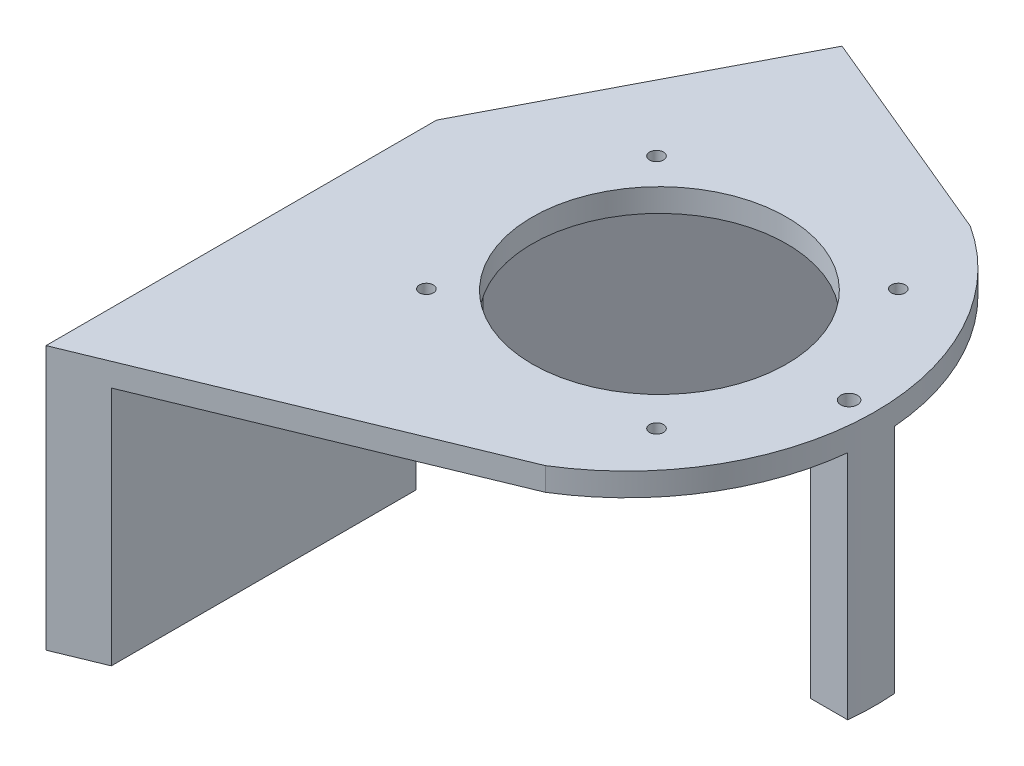
ISO-10303-21;
HEADER;
FILE_DESCRIPTION(('STEP AP214'),'2;1');
FILE_NAME('part.step','',(''),(''),'','','');
FILE_SCHEMA(('AUTOMOTIVE_DESIGN { 1 0 10303 214 1 1 1 1 }'));
ENDSEC;
DATA;
#1=APPLICATION_CONTEXT('core data for automotive mechanical design processes');
#2=APPLICATION_PROTOCOL_DEFINITION('international standard','automotive_design',2000,#1);
#3=PRODUCT_CONTEXT('',#1,'mechanical');
#4=PRODUCT('Part','Part','',(#3));
#5=PRODUCT_RELATED_PRODUCT_CATEGORY('part','',(#4));
#6=PRODUCT_DEFINITION_FORMATION('','',#4);
#7=PRODUCT_DEFINITION_CONTEXT('part definition',#1,'design');
#8=PRODUCT_DEFINITION('design','',#6,#7);
#9=PRODUCT_DEFINITION_SHAPE('','',#8);
#10=(LENGTH_UNIT() NAMED_UNIT(*) SI_UNIT(.MILLI.,.METRE.));
#11=(NAMED_UNIT(*) PLANE_ANGLE_UNIT() SI_UNIT($,.RADIAN.));
#12=(NAMED_UNIT(*) SI_UNIT($,.STERADIAN.) SOLID_ANGLE_UNIT());
#13=UNCERTAINTY_MEASURE_WITH_UNIT(LENGTH_MEASURE(1.E-05),#10,'distance_accuracy_value','');
#14=(GEOMETRIC_REPRESENTATION_CONTEXT(3) GLOBAL_UNCERTAINTY_ASSIGNED_CONTEXT((#13)) GLOBAL_UNIT_ASSIGNED_CONTEXT((#10,
#11,#12)) REPRESENTATION_CONTEXT('',''));
#15=CARTESIAN_POINT('',(0.,0.,0.));
#16=DIRECTION('',(0.,0.,1.));
#17=DIRECTION('',(1.,0.,0.));
#18=AXIS2_PLACEMENT_3D('',#15,#16,#17);
#19=CARTESIAN_POINT('',(128.65,0.,38.6));
#20=DIRECTION('',(0.,-1.,0.));
#21=DIRECTION('',(0.,0.,-1.));
#22=AXIS2_PLACEMENT_3D('',#19,#20,#21);
#23=PLANE('',#22);
#24=CARTESIAN_POINT('',(119.744162976711,0.,26.4841267309058));
#25=DIRECTION('',(0.,1.,0.));
#26=DIRECTION('',(0.,0.,1.));
#27=AXIS2_PLACEMENT_3D('',#24,#25,#26);
#28=CIRCLE('',#27,0.749999999999999);
#29=CARTESIAN_POINT('',(119.744162976711,0.,27.2341267309058));
#30=VERTEX_POINT('',#29);
#31=EDGE_CURVE('E240',#30,#30,#28,.T.);
#32=ORIENTED_EDGE('',*,*,#31,.T.);
#33=EDGE_LOOP('',(#32));
#34=FACE_BOUND('',#33,.T.);
#35=CARTESIAN_POINT('',(145.236491005935,0.,25.8538359853882));
#36=DIRECTION('',(0.,1.,0.));
#37=DIRECTION('',(0.,0.,1.));
#38=AXIS2_PLACEMENT_3D('',#35,#36,#37);
#39=CIRCLE('',#38,0.750000000000012);
#40=CARTESIAN_POINT('',(145.236491005935,0.,26.6038359853882));
#41=VERTEX_POINT('',#40);
#42=EDGE_CURVE('E252',#41,#41,#39,.T.);
#43=ORIENTED_EDGE('',*,*,#42,.T.);
#44=EDGE_LOOP('',(#43));
#45=FACE_BOUND('',#44,.T.);
#46=CARTESIAN_POINT('',(132.490326991323,0.,38.9151453727588));
#47=DIRECTION('',(0.,1.,0.));
#48=DIRECTION('',(0.,0.,1.));
#49=AXIS2_PLACEMENT_3D('',#46,#47,#48);
#50=CIRCLE('',#49,13.75);
#51=CARTESIAN_POINT('',(132.490326991323,0.,52.6651453727588));
#52=VERTEX_POINT('',#51);
#53=EDGE_CURVE('E258',#52,#52,#50,.T.);
#54=ORIENTED_EDGE('',*,*,#53,.T.);
#55=EDGE_LOOP('',(#54));
#56=FACE_BOUND('',#55,.T.);
#57=CARTESIAN_POINT('',(119.744162976711,0.,51.3461640146118));
#58=DIRECTION('',(0.,1.,0.));
#59=DIRECTION('',(0.,0.,-1.));
#60=AXIS2_PLACEMENT_3D('',#57,#58,#59);
#61=CIRCLE('',#60,0.749999999999999);
#62=CARTESIAN_POINT('',(119.744162976711,0.,50.5961640146118));
#63=VERTEX_POINT('',#62);
#64=EDGE_CURVE('E246',#63,#63,#61,.T.);
#65=ORIENTED_EDGE('',*,*,#64,.T.);
#66=EDGE_LOOP('',(#65));
#67=FACE_BOUND('',#66,.T.);
#68=CARTESIAN_POINT('',(145.236491005935,0.,51.9764547601294));
#69=DIRECTION('',(0.,1.,0.));
#70=DIRECTION('',(0.,0.,-1.));
#71=AXIS2_PLACEMENT_3D('',#68,#69,#70);
#72=CIRCLE('',#71,0.750000000000012);
#73=CARTESIAN_POINT('',(145.236491005935,0.,51.2264547601294));
#74=VERTEX_POINT('',#73);
#75=EDGE_CURVE('E236',#74,#74,#72,.T.);
#76=ORIENTED_EDGE('',*,*,#75,.T.);
#77=EDGE_LOOP('',(#76));
#78=FACE_BOUND('',#77,.T.);
#79=DIRECTION('',(0.,0.,-1.));
#80=VECTOR('',#79,1.);
#81=CARTESIAN_POINT('',(151.332558904024,0.,41.4151453727588));
#82=LINE('',#81,#80);
#83=CARTESIAN_POINT('',(151.332558904024,0.,41.4151453727588));
#84=VERTEX_POINT('',#83);
#85=CARTESIAN_POINT('',(151.332558904024,0.,36.4151453727588));
#86=VERTEX_POINT('',#85);
#87=EDGE_CURVE('E299',#84,#86,#82,.T.);
#88=ORIENTED_EDGE('',*,*,#87,.F.);
#89=DIRECTION('',(-1.,0.,0.));
#90=VECTOR('',#89,1.);
#91=CARTESIAN_POINT('',(155.332558904024,0.,41.4151453727588));
#92=LINE('',#91,#90);
#93=CARTESIAN_POINT('',(155.332558904024,0.,41.4151453727588));
#94=VERTEX_POINT('',#93);
#95=EDGE_CURVE('E166',#94,#84,#92,.T.);
#96=ORIENTED_EDGE('',*,*,#95,.F.);
#97=CARTESIAN_POINT('',(128.65,0.,38.6));
#98=DIRECTION('',(0.,1.,0.));
#99=DIRECTION('',(0.,0.,-1.));
#100=AXIS2_PLACEMENT_3D('',#97,#98,#99);
#101=CIRCLE('',#100,26.8306539826459);
#102=CARTESIAN_POINT('',(142.702591634753,0.,61.4562608815036));
#103=VERTEX_POINT('',#102);
#104=EDGE_CURVE('E281',#103,#94,#101,.T.);
#105=ORIENTED_EDGE('',*,*,#104,.F.);
#106=DIRECTION('',(0.924565071582839,0.,-0.381024183496298));
#107=VECTOR('',#106,1.);
#108=CARTESIAN_POINT('',(104.5,0.,77.2));
#109=LINE('',#108,#107);
#110=CARTESIAN_POINT('',(109.5,0.,75.1394409587419));
#111=VERTEX_POINT('',#110);
#112=EDGE_CURVE('E55',#111,#103,#109,.T.);
#113=ORIENTED_EDGE('',*,*,#112,.F.);
#114=DIRECTION('',(0.,0.,1.));
#115=VECTOR('',#114,1.);
#116=CARTESIAN_POINT('',(109.5,0.,42.2));
#117=LINE('',#116,#115);
#118=CARTESIAN_POINT('',(109.5,0.,35.));
#119=VERTEX_POINT('',#118);
#120=EDGE_CURVE('E215',#119,#111,#117,.T.);
#121=ORIENTED_EDGE('',*,*,#120,.F.);
#122=DIRECTION('',(-0.461215454857083,0.,0.887288174270893));
#123=VECTOR('',#122,1.);
#124=CARTESIAN_POINT('',(123.601295817376,0.,7.87186955924821));
#125=LINE('',#124,#123);
#126=CARTESIAN_POINT('',(123.592649809714,0.,7.88850278407283));
#127=VERTEX_POINT('',#126);
#128=EDGE_CURVE('E184',#127,#119,#125,.T.);
#129=ORIENTED_EDGE('',*,*,#128,.F.);
#130=DIRECTION('',(-0.92295891206317,0.,-0.384898488751476));
#131=VECTOR('',#130,1.);
#132=CARTESIAN_POINT('',(143.235603671051,0.,16.0801385730839));
#133=LINE('',#132,#131);
#134=CARTESIAN_POINT('',(143.235603671051,0.,16.0801385730839));
#135=VERTEX_POINT('',#134);
#136=EDGE_CURVE('E270',#135,#127,#133,.T.);
#137=ORIENTED_EDGE('',*,*,#136,.F.);
#138=CARTESIAN_POINT('',(155.391548260979,0.,36.4151453727588));
#139=VERTEX_POINT('',#138);
#140=EDGE_CURVE('E280',#139,#135,#101,.T.);
#141=ORIENTED_EDGE('',*,*,#140,.F.);
#142=DIRECTION('',(1.,0.,0.));
#143=VECTOR('',#142,1.);
#144=CARTESIAN_POINT('',(151.332558904024,0.,36.4151453727588));
#145=LINE('',#144,#143);
#146=EDGE_CURVE('E47',#86,#139,#145,.T.);
#147=ORIENTED_EDGE('',*,*,#146,.F.);
#148=EDGE_LOOP('',(#88,#96,#105,#113,#121,#129,#137,#141,#147));
#149=FACE_BOUND('',#148,.T.);
#150=ADVANCED_FACE('F32',(#34,#45,#56,#67,#78,#149),#23,.T.);
#151=CARTESIAN_POINT('',(128.65,2.5,38.6));
#152=DIRECTION('',(0.,-1.,0.));
#153=DIRECTION('',(0.,0.,-1.));
#154=AXIS2_PLACEMENT_3D('',#151,#152,#153);
#155=PLANE('',#154);
#156=CARTESIAN_POINT('',(152.978803114014,2.5,38.9151453727588));
#157=DIRECTION('',(0.,1.,0.));
#158=DIRECTION('',(0.,0.,1.));
#159=AXIS2_PLACEMENT_3D('',#156,#157,#158);
#160=CIRCLE('',#159,0.900000000000005);
#161=CARTESIAN_POINT('',(152.978803114014,2.5,39.8151453727588));
#162=VERTEX_POINT('',#161);
#163=EDGE_CURVE('E304',#162,#162,#160,.T.);
#164=ORIENTED_EDGE('',*,*,#163,.F.);
#165=EDGE_LOOP('',(#164));
#166=FACE_BOUND('',#165,.T.);
#167=DIRECTION('',(0.,0.,1.));
#168=VECTOR('',#167,1.);
#169=CARTESIAN_POINT('',(104.5,2.5,35.));
#170=LINE('',#169,#168);
#171=CARTESIAN_POINT('',(104.5,2.5,35.));
#172=VERTEX_POINT('',#171);
#173=CARTESIAN_POINT('',(104.5,2.5,77.2));
#174=VERTEX_POINT('',#173);
#175=EDGE_CURVE('E266',#172,#174,#170,.T.);
#176=ORIENTED_EDGE('',*,*,#175,.T.);
#177=DIRECTION('',(0.924565071582839,0.,-0.381024183496298));
#178=VECTOR('',#177,1.);
#179=CARTESIAN_POINT('',(104.5,2.5,77.2));
#180=LINE('',#179,#178);
#181=CARTESIAN_POINT('',(142.702591634753,2.5,61.4562608815036));
#182=VERTEX_POINT('',#181);
#183=EDGE_CURVE('E269',#174,#182,#180,.T.);
#184=ORIENTED_EDGE('',*,*,#183,.T.);
#185=CARTESIAN_POINT('',(128.65,2.5,38.6));
#186=DIRECTION('',(0.,1.,0.));
#187=DIRECTION('',(0.,0.,-1.));
#188=AXIS2_PLACEMENT_3D('',#185,#186,#187);
#189=CIRCLE('',#188,26.8306539826459);
#190=CARTESIAN_POINT('',(143.235603671051,2.5,16.0801385730839));
#191=VERTEX_POINT('',#190);
#192=EDGE_CURVE('E272',#182,#191,#189,.T.);
#193=ORIENTED_EDGE('',*,*,#192,.T.);
#194=DIRECTION('',(-0.92295891206317,0.,-0.384898488751476));
#195=VECTOR('',#194,1.);
#196=CARTESIAN_POINT('',(143.235603671051,2.5,16.0801385730839));
#197=LINE('',#196,#195);
#198=CARTESIAN_POINT('',(119.483416209958,2.5,6.17484274807259));
#199=VERTEX_POINT('',#198);
#200=EDGE_CURVE('E274',#191,#199,#197,.T.);
#201=ORIENTED_EDGE('',*,*,#200,.T.);
#202=DIRECTION('',(-0.461215454857083,0.,0.887288174270893));
#203=VECTOR('',#202,1.);
#204=CARTESIAN_POINT('',(104.5,2.5,35.));
#205=LINE('',#204,#203);
#206=EDGE_CURVE('E276',#199,#172,#205,.T.);
#207=ORIENTED_EDGE('',*,*,#206,.T.);
#208=EDGE_LOOP('',(#176,#184,#193,#201,#207));
#209=FACE_BOUND('',#208,.T.);
#210=CARTESIAN_POINT('',(132.490326991323,2.5,38.9151453727588));
#211=DIRECTION('',(0.,1.,0.));
#212=DIRECTION('',(0.,0.,1.));
#213=AXIS2_PLACEMENT_3D('',#210,#211,#212);
#214=CIRCLE('',#213,13.75);
#215=CARTESIAN_POINT('',(132.490326991323,2.5,52.6651453727588));
#216=VERTEX_POINT('',#215);
#217=EDGE_CURVE('E261',#216,#216,#214,.T.);
#218=ORIENTED_EDGE('',*,*,#217,.F.);
#219=EDGE_LOOP('',(#218));
#220=FACE_BOUND('',#219,.T.);
#221=CARTESIAN_POINT('',(145.236491005935,2.5,25.8538359853882));
#222=DIRECTION('',(0.,1.,0.));
#223=DIRECTION('',(0.,0.,1.));
#224=AXIS2_PLACEMENT_3D('',#221,#222,#223);
#225=CIRCLE('',#224,0.750000000000012);
#226=CARTESIAN_POINT('',(145.236491005935,2.5,26.6038359853882));
#227=VERTEX_POINT('',#226);
#228=EDGE_CURVE('E255',#227,#227,#225,.T.);
#229=ORIENTED_EDGE('',*,*,#228,.F.);
#230=EDGE_LOOP('',(#229));
#231=FACE_BOUND('',#230,.T.);
#232=CARTESIAN_POINT('',(119.744162976711,2.5,51.3461640146118));
#233=DIRECTION('',(0.,1.,0.));
#234=DIRECTION('',(0.,0.,-1.));
#235=AXIS2_PLACEMENT_3D('',#232,#233,#234);
#236=CIRCLE('',#235,0.749999999999999);
#237=CARTESIAN_POINT('',(119.744162976711,2.5,50.5961640146118));
#238=VERTEX_POINT('',#237);
#239=EDGE_CURVE('E249',#238,#238,#236,.T.);
#240=ORIENTED_EDGE('',*,*,#239,.F.);
#241=EDGE_LOOP('',(#240));
#242=FACE_BOUND('',#241,.T.);
#243=CARTESIAN_POINT('',(119.744162976711,2.5,26.4841267309058));
#244=DIRECTION('',(0.,1.,0.));
#245=DIRECTION('',(0.,0.,1.));
#246=AXIS2_PLACEMENT_3D('',#243,#244,#245);
#247=CIRCLE('',#246,0.749999999999999);
#248=CARTESIAN_POINT('',(119.744162976711,2.5,27.2341267309058));
#249=VERTEX_POINT('',#248);
#250=EDGE_CURVE('E243',#249,#249,#247,.T.);
#251=ORIENTED_EDGE('',*,*,#250,.F.);
#252=EDGE_LOOP('',(#251));
#253=FACE_BOUND('',#252,.T.);
#254=CARTESIAN_POINT('',(145.236491005935,2.5,51.9764547601294));
#255=DIRECTION('',(0.,1.,0.));
#256=DIRECTION('',(0.,0.,-1.));
#257=AXIS2_PLACEMENT_3D('',#254,#255,#256);
#258=CIRCLE('',#257,0.750000000000012);
#259=CARTESIAN_POINT('',(145.236491005935,2.5,51.2264547601294));
#260=VERTEX_POINT('',#259);
#261=EDGE_CURVE('E237',#260,#260,#258,.T.);
#262=ORIENTED_EDGE('',*,*,#261,.F.);
#263=EDGE_LOOP('',(#262));
#264=FACE_BOUND('',#263,.T.);
#265=ADVANCED_FACE('F321',(#166,#209,#220,#231,#242,#253,#264),#155,.F.);
#266=CARTESIAN_POINT('',(104.5,2.5,35.));
#267=DIRECTION('',(1.,0.,0.));
#268=DIRECTION('',(0.,0.,-1.));
#269=AXIS2_PLACEMENT_3D('',#266,#267,#268);
#270=PLANE('',#269);
#271=DIRECTION('',(0.,-1.,0.));
#272=VECTOR('',#271,1.);
#273=CARTESIAN_POINT('',(104.5,2.5,35.));
#274=LINE('',#273,#272);
#275=CARTESIAN_POINT('',(104.5,-21.,35.));
#276=VERTEX_POINT('',#275);
#277=EDGE_CURVE('E278',#172,#276,#274,.T.);
#278=ORIENTED_EDGE('',*,*,#277,.T.);
#279=DIRECTION('',(0.,0.,1.));
#280=VECTOR('',#279,1.);
#281=CARTESIAN_POINT('',(104.5,-21.,35.));
#282=LINE('',#281,#280);
#283=CARTESIAN_POINT('',(104.5,-21.,42.2));
#284=VERTEX_POINT('',#283);
#285=EDGE_CURVE('E168',#276,#284,#282,.T.);
#286=ORIENTED_EDGE('',*,*,#285,.T.);
#287=DIRECTION('',(0.,1.,0.));
#288=VECTOR('',#287,1.);
#289=CARTESIAN_POINT('',(104.5,-26.,42.2));
#290=LINE('',#289,#288);
#291=CARTESIAN_POINT('',(104.5,-26.,42.2));
#292=VERTEX_POINT('',#291);
#293=EDGE_CURVE('E233',#292,#284,#290,.T.);
#294=ORIENTED_EDGE('',*,*,#293,.F.);
#295=DIRECTION('',(0.,0.,-1.));
#296=VECTOR('',#295,1.);
#297=CARTESIAN_POINT('',(104.5,-26.,77.2));
#298=LINE('',#297,#296);
#299=CARTESIAN_POINT('',(104.5,-26.,77.2));
#300=VERTEX_POINT('',#299);
#301=EDGE_CURVE('E216',#300,#292,#298,.T.);
#302=ORIENTED_EDGE('',*,*,#301,.F.);
#303=DIRECTION('',(0.,-1.,0.));
#304=VECTOR('',#303,1.);
#305=CARTESIAN_POINT('',(104.5,2.5,77.2));
#306=LINE('',#305,#304);
#307=EDGE_CURVE('E11',#174,#300,#306,.T.);
#308=ORIENTED_EDGE('',*,*,#307,.F.);
#309=ORIENTED_EDGE('',*,*,#175,.F.);
#310=EDGE_LOOP('',(#278,#286,#294,#302,#308,#309));
#311=FACE_BOUND('',#310,.T.);
#312=ADVANCED_FACE('F34',(#311),#270,.F.);
#313=CARTESIAN_POINT('',(104.5,2.5,77.2));
#314=DIRECTION('',(-0.381024183496298,0.,-0.924565071582838));
#315=DIRECTION('',(-0.924565071582838,0.,0.381024183496298));
#316=AXIS2_PLACEMENT_3D('',#313,#314,#315);
#317=PLANE('',#316);
#318=ORIENTED_EDGE('',*,*,#307,.T.);
#319=DIRECTION('',(-0.924565071582838,0.,0.381024183496299));
#320=VECTOR('',#319,1.);
#321=CARTESIAN_POINT('',(109.5,-26.,75.1394409587419));
#322=LINE('',#321,#320);
#323=CARTESIAN_POINT('',(109.5,-26.,75.1394409587419));
#324=VERTEX_POINT('',#323);
#325=EDGE_CURVE('E223',#324,#300,#322,.T.);
#326=ORIENTED_EDGE('',*,*,#325,.F.);
#327=DIRECTION('',(0.,1.,0.));
#328=VECTOR('',#327,1.);
#329=CARTESIAN_POINT('',(109.5,-26.,75.1394409587419));
#330=LINE('',#329,#328);
#331=EDGE_CURVE('E226',#324,#111,#330,.T.);
#332=ORIENTED_EDGE('',*,*,#331,.T.);
#333=ORIENTED_EDGE('',*,*,#112,.T.);
#334=DIRECTION('',(0.,-1.,0.));
#335=VECTOR('',#334,1.);
#336=CARTESIAN_POINT('',(142.702591634753,2.5,61.4562608815036));
#337=LINE('',#336,#335);
#338=EDGE_CURVE('E40',#182,#103,#337,.T.);
#339=ORIENTED_EDGE('',*,*,#338,.F.);
#340=ORIENTED_EDGE('',*,*,#183,.F.);
#341=EDGE_LOOP('',(#318,#326,#332,#333,#339,#340));
#342=FACE_BOUND('',#341,.T.);
#343=ADVANCED_FACE('F326',(#342),#317,.F.);
#344=CARTESIAN_POINT('',(128.65,2.5,38.6));
#345=DIRECTION('',(0.,-1.,0.));
#346=DIRECTION('',(0.,0.,-1.));
#347=AXIS2_PLACEMENT_3D('',#344,#345,#346);
#348=CYLINDRICAL_SURFACE('',#347,26.8306539826459);
#349=ORIENTED_EDGE('',*,*,#104,.T.);
#350=DIRECTION('',(0.,1.,0.));
#351=VECTOR('',#350,1.);
#352=CARTESIAN_POINT('',(155.332558904024,-25.,41.4151453727588));
#353=LINE('',#352,#351);
#354=CARTESIAN_POINT('',(155.332558904024,-25.,41.4151453727588));
#355=VERTEX_POINT('',#354);
#356=EDGE_CURVE('E310',#355,#94,#353,.T.);
#357=ORIENTED_EDGE('',*,*,#356,.F.);
#358=CARTESIAN_POINT('',(128.650000000002,-25.,38.6000000000002));
#359=DIRECTION('',(0.,1.,0.));
#360=DIRECTION('',(0.,0.,1.));
#361=AXIS2_PLACEMENT_3D('',#358,#359,#360);
#362=CIRCLE('',#361,26.8306539826441);
#363=CARTESIAN_POINT('',(155.391548260979,-25.,36.4151453727588));
#364=VERTEX_POINT('',#363);
#365=EDGE_CURVE('E161',#355,#364,#362,.T.);
#366=ORIENTED_EDGE('',*,*,#365,.T.);
#367=DIRECTION('',(0.,1.,0.));
#368=VECTOR('',#367,1.);
#369=CARTESIAN_POINT('',(155.391548260979,-25.,36.4151453727588));
#370=LINE('',#369,#368);
#371=EDGE_CURVE('E173',#364,#139,#370,.T.);
#372=ORIENTED_EDGE('',*,*,#371,.T.);
#373=ORIENTED_EDGE('',*,*,#140,.T.);
#374=DIRECTION('',(0.,-1.,0.));
#375=VECTOR('',#374,1.);
#376=CARTESIAN_POINT('',(143.235603671051,2.5,16.0801385730839));
#377=LINE('',#376,#375);
#378=EDGE_CURVE('E290',#191,#135,#377,.T.);
#379=ORIENTED_EDGE('',*,*,#378,.F.);
#380=ORIENTED_EDGE('',*,*,#192,.F.);
#381=ORIENTED_EDGE('',*,*,#338,.T.);
#382=EDGE_LOOP('',(#349,#357,#366,#372,#373,#379,#380,#381));
#383=FACE_BOUND('',#382,.T.);
#384=ADVANCED_FACE('F296',(#383),#348,.T.);
#385=CARTESIAN_POINT('',(143.235603671051,2.5,16.0801385730839));
#386=DIRECTION('',(-0.384898488751476,0.,0.92295891206317));
#387=DIRECTION('',(0.92295891206317,0.,0.384898488751476));
#388=AXIS2_PLACEMENT_3D('',#385,#386,#387);
#389=PLANE('',#388);
#390=ORIENTED_EDGE('',*,*,#136,.T.);
#391=DIRECTION('',(-0.92295891206317,0.,-0.384898488751476));
#392=VECTOR('',#391,1.);
#393=CARTESIAN_POINT('',(143.235603671051,0.,16.0801385730839));
#394=LINE('',#393,#392);
#395=CARTESIAN_POINT('',(119.483416209958,0.,6.17484274807259));
#396=VERTEX_POINT('',#395);
#397=EDGE_CURVE('E212',#127,#396,#394,.T.);
#398=ORIENTED_EDGE('',*,*,#397,.T.);
#399=DIRECTION('',(0.,-1.,0.));
#400=VECTOR('',#399,1.);
#401=CARTESIAN_POINT('',(119.483416209958,2.5,6.17484274807259));
#402=LINE('',#401,#400);
#403=EDGE_CURVE('E287',#199,#396,#402,.T.);
#404=ORIENTED_EDGE('',*,*,#403,.F.);
#405=ORIENTED_EDGE('',*,*,#200,.F.);
#406=ORIENTED_EDGE('',*,*,#378,.T.);
#407=EDGE_LOOP('',(#390,#398,#404,#405,#406));
#408=FACE_BOUND('',#407,.T.);
#409=ADVANCED_FACE('F316',(#408),#389,.F.);
#410=CARTESIAN_POINT('',(104.5,2.5,35.));
#411=DIRECTION('',(0.887288174270893,0.,0.461215454857083));
#412=DIRECTION('',(0.461215454857083,0.,-0.887288174270893));
#413=AXIS2_PLACEMENT_3D('',#410,#411,#412);
#414=PLANE('',#413);
#415=ORIENTED_EDGE('',*,*,#403,.T.);
#416=DIRECTION('',(0.,1.,0.));
#417=VECTOR('',#416,1.);
#418=CARTESIAN_POINT('',(119.483416209958,-26.,6.17484274807259));
#419=LINE('',#418,#417);
#420=CARTESIAN_POINT('',(119.483416209958,-26.,6.17484274807259));
#421=VERTEX_POINT('',#420);
#422=EDGE_CURVE('E204',#421,#396,#419,.T.);
#423=ORIENTED_EDGE('',*,*,#422,.F.);
#424=DIRECTION('',(0.461215454857083,0.,-0.887288174270893));
#425=VECTOR('',#424,1.);
#426=CARTESIAN_POINT('',(104.5,-26.,35.));
#427=LINE('',#426,#425);
#428=CARTESIAN_POINT('',(104.5,-26.,35.));
#429=VERTEX_POINT('',#428);
#430=EDGE_CURVE('E193',#429,#421,#427,.T.);
#431=ORIENTED_EDGE('',*,*,#430,.F.);
#432=DIRECTION('',(0.,1.,0.));
#433=VECTOR('',#432,1.);
#434=CARTESIAN_POINT('',(104.5,-26.,35.));
#435=LINE('',#434,#433);
#436=EDGE_CURVE('E206',#429,#276,#435,.T.);
#437=ORIENTED_EDGE('',*,*,#436,.T.);
#438=ORIENTED_EDGE('',*,*,#277,.F.);
#439=ORIENTED_EDGE('',*,*,#206,.F.);
#440=EDGE_LOOP('',(#415,#423,#431,#437,#438,#439));
#441=FACE_BOUND('',#440,.T.);
#442=ADVANCED_FACE('F359',(#441),#414,.F.);
#443=CARTESIAN_POINT('',(132.490326991323,2.5,38.9151453727588));
#444=DIRECTION('',(0.,-1.,0.));
#445=DIRECTION('',(0.,0.,-1.));
#446=AXIS2_PLACEMENT_3D('',#443,#444,#445);
#447=CYLINDRICAL_SURFACE('',#446,13.75);
#448=ORIENTED_EDGE('',*,*,#217,.T.);
#449=EDGE_LOOP('',(#448));
#450=FACE_BOUND('',#449,.T.);
#451=ORIENTED_EDGE('',*,*,#53,.F.);
#452=EDGE_LOOP('',(#451));
#453=FACE_BOUND('',#452,.T.);
#454=ADVANCED_FACE('F389',(#450,#453),#447,.F.);
#455=CARTESIAN_POINT('',(145.236491005935,2.5,25.8538359853882));
#456=DIRECTION('',(0.,-1.,0.));
#457=DIRECTION('',(0.,0.,-1.));
#458=AXIS2_PLACEMENT_3D('',#455,#456,#457);
#459=CYLINDRICAL_SURFACE('',#458,0.750000000000012);
#460=ORIENTED_EDGE('',*,*,#228,.T.);
#461=EDGE_LOOP('',(#460));
#462=FACE_BOUND('',#461,.T.);
#463=ORIENTED_EDGE('',*,*,#42,.F.);
#464=EDGE_LOOP('',(#463));
#465=FACE_BOUND('',#464,.T.);
#466=ADVANCED_FACE('F574',(#462,#465),#459,.F.);
#467=CARTESIAN_POINT('',(119.744162976711,2.5,51.3461640146118));
#468=DIRECTION('',(0.,-1.,0.));
#469=DIRECTION('',(0.,0.,-1.));
#470=AXIS2_PLACEMENT_3D('',#467,#468,#469);
#471=CYLINDRICAL_SURFACE('',#470,0.749999999999999);
#472=ORIENTED_EDGE('',*,*,#239,.T.);
#473=EDGE_LOOP('',(#472));
#474=FACE_BOUND('',#473,.T.);
#475=ORIENTED_EDGE('',*,*,#64,.F.);
#476=EDGE_LOOP('',(#475));
#477=FACE_BOUND('',#476,.T.);
#478=ADVANCED_FACE('F564',(#474,#477),#471,.F.);
#479=CARTESIAN_POINT('',(119.744162976711,2.5,26.4841267309058));
#480=DIRECTION('',(0.,-1.,0.));
#481=DIRECTION('',(0.,0.,-1.));
#482=AXIS2_PLACEMENT_3D('',#479,#480,#481);
#483=CYLINDRICAL_SURFACE('',#482,0.749999999999999);
#484=ORIENTED_EDGE('',*,*,#250,.T.);
#485=EDGE_LOOP('',(#484));
#486=FACE_BOUND('',#485,.T.);
#487=ORIENTED_EDGE('',*,*,#31,.F.);
#488=EDGE_LOOP('',(#487));
#489=FACE_BOUND('',#488,.T.);
#490=ADVANCED_FACE('F553',(#486,#489),#483,.F.);
#491=CARTESIAN_POINT('',(145.236491005935,2.5,51.9764547601294));
#492=DIRECTION('',(0.,-1.,0.));
#493=DIRECTION('',(0.,0.,-1.));
#494=AXIS2_PLACEMENT_3D('',#491,#492,#493);
#495=CYLINDRICAL_SURFACE('',#494,0.750000000000012);
#496=ORIENTED_EDGE('',*,*,#261,.T.);
#497=EDGE_LOOP('',(#496));
#498=FACE_BOUND('',#497,.T.);
#499=ORIENTED_EDGE('',*,*,#75,.F.);
#500=EDGE_LOOP('',(#499));
#501=FACE_BOUND('',#500,.T.);
#502=ADVANCED_FACE('F549',(#498,#501),#495,.F.);
#503=CARTESIAN_POINT('',(104.5,-26.,42.2));
#504=DIRECTION('',(0.,0.,1.));
#505=DIRECTION('',(1.,0.,0.));
#506=AXIS2_PLACEMENT_3D('',#503,#504,#505);
#507=PLANE('',#506);
#508=ORIENTED_EDGE('',*,*,#293,.T.);
#509=DIRECTION('',(-1.,0.,0.));
#510=VECTOR('',#509,1.);
#511=CARTESIAN_POINT('',(109.5,-21.,42.2));
#512=LINE('',#511,#510);
#513=CARTESIAN_POINT('',(109.5,-21.,42.2));
#514=VERTEX_POINT('',#513);
#515=EDGE_CURVE('E182',#514,#284,#512,.T.);
#516=ORIENTED_EDGE('',*,*,#515,.F.);
#517=DIRECTION('',(0.,1.,0.));
#518=VECTOR('',#517,1.);
#519=CARTESIAN_POINT('',(109.5,-26.,42.2));
#520=LINE('',#519,#518);
#521=CARTESIAN_POINT('',(109.5,-26.,42.2));
#522=VERTEX_POINT('',#521);
#523=EDGE_CURVE('E230',#522,#514,#520,.T.);
#524=ORIENTED_EDGE('',*,*,#523,.F.);
#525=DIRECTION('',(1.,0.,0.));
#526=VECTOR('',#525,1.);
#527=CARTESIAN_POINT('',(104.5,-26.,42.2));
#528=LINE('',#527,#526);
#529=EDGE_CURVE('E219',#292,#522,#528,.T.);
#530=ORIENTED_EDGE('',*,*,#529,.F.);
#531=EDGE_LOOP('',(#508,#516,#524,#530));
#532=FACE_BOUND('',#531,.T.);
#533=ADVANCED_FACE('F338',(#532),#507,.F.);
#534=CARTESIAN_POINT('',(109.5,-26.,42.2));
#535=DIRECTION('',(-1.,0.,0.));
#536=DIRECTION('',(0.,0.,1.));
#537=AXIS2_PLACEMENT_3D('',#534,#535,#536);
#538=PLANE('',#537);
#539=ORIENTED_EDGE('',*,*,#120,.T.);
#540=ORIENTED_EDGE('',*,*,#331,.F.);
#541=DIRECTION('',(0.,0.,1.));
#542=VECTOR('',#541,1.);
#543=CARTESIAN_POINT('',(109.5,-26.,42.2));
#544=LINE('',#543,#542);
#545=EDGE_CURVE('E221',#522,#324,#544,.T.);
#546=ORIENTED_EDGE('',*,*,#545,.F.);
#547=ORIENTED_EDGE('',*,*,#523,.T.);
#548=DIRECTION('',(0.,0.,1.));
#549=VECTOR('',#548,1.);
#550=CARTESIAN_POINT('',(109.5,-21.,35.));
#551=LINE('',#550,#549);
#552=CARTESIAN_POINT('',(109.5,-21.,35.));
#553=VERTEX_POINT('',#552);
#554=EDGE_CURVE('E179',#553,#514,#551,.T.);
#555=ORIENTED_EDGE('',*,*,#554,.F.);
#556=DIRECTION('',(0.,-1.,0.));
#557=VECTOR('',#556,1.);
#558=CARTESIAN_POINT('',(109.5,0.,35.));
#559=LINE('',#558,#557);
#560=EDGE_CURVE('E171',#119,#553,#559,.T.);
#561=ORIENTED_EDGE('',*,*,#560,.F.);
#562=EDGE_LOOP('',(#539,#540,#546,#547,#555,#561));
#563=FACE_BOUND('',#562,.T.);
#564=ADVANCED_FACE('F342',(#563),#538,.F.);
#565=CARTESIAN_POINT('',(0.,-26.,0.));
#566=DIRECTION('',(0.,-1.,0.));
#567=DIRECTION('',(0.,0.,-1.));
#568=AXIS2_PLACEMENT_3D('',#565,#566,#567);
#569=PLANE('',#568);
#570=ORIENTED_EDGE('',*,*,#301,.T.);
#571=ORIENTED_EDGE('',*,*,#529,.T.);
#572=ORIENTED_EDGE('',*,*,#545,.T.);
#573=ORIENTED_EDGE('',*,*,#325,.T.);
#574=EDGE_LOOP('',(#570,#571,#572,#573));
#575=FACE_BOUND('',#574,.T.);
#576=ADVANCED_FACE('F331',(#575),#569,.T.);
#577=CARTESIAN_POINT('',(0.,0.,0.));
#578=DIRECTION('',(0.,1.,0.));
#579=DIRECTION('',(0.,0.,1.));
#580=AXIS2_PLACEMENT_3D('',#577,#578,#579);
#581=PLANE('',#580);
#582=ORIENTED_EDGE('',*,*,#397,.F.);
#583=CARTESIAN_POINT('',(123.601295817376,0.,7.87186955924821));
#584=VERTEX_POINT('',#583);
#585=EDGE_CURVE('E198',#584,#127,#125,.T.);
#586=ORIENTED_EDGE('',*,*,#585,.F.);
#587=DIRECTION('',(0.924565071582838,0.,0.381024183496299));
#588=VECTOR('',#587,1.);
#589=CARTESIAN_POINT('',(119.483416209958,0.,6.17484274807259));
#590=LINE('',#589,#588);
#591=EDGE_CURVE('E191',#396,#584,#590,.T.);
#592=ORIENTED_EDGE('',*,*,#591,.F.);
#593=EDGE_LOOP('',(#582,#586,#592));
#594=FACE_BOUND('',#593,.T.);
#595=ADVANCED_FACE('F352',(#594),#581,.T.);
#596=CARTESIAN_POINT('',(123.601295817376,-26.,7.87186955924821));
#597=DIRECTION('',(-0.887288174270893,0.,-0.461215454857083));
#598=DIRECTION('',(-0.461215454857083,0.,0.887288174270893));
#599=AXIS2_PLACEMENT_3D('',#596,#597,#598);
#600=PLANE('',#599);
#601=ORIENTED_EDGE('',*,*,#585,.T.);
#602=ORIENTED_EDGE('',*,*,#128,.T.);
#603=ORIENTED_EDGE('',*,*,#560,.T.);
#604=DIRECTION('',(0.,1.,0.));
#605=VECTOR('',#604,1.);
#606=CARTESIAN_POINT('',(109.5,-26.,35.));
#607=LINE('',#606,#605);
#608=CARTESIAN_POINT('',(109.5,-26.,35.));
#609=VERTEX_POINT('',#608);
#610=EDGE_CURVE('E209',#609,#553,#607,.T.);
#611=ORIENTED_EDGE('',*,*,#610,.F.);
#612=DIRECTION('',(-0.461215454857083,0.,0.887288174270893));
#613=VECTOR('',#612,1.);
#614=CARTESIAN_POINT('',(123.601295817376,-26.,7.87186955924821));
#615=LINE('',#614,#613);
#616=CARTESIAN_POINT('',(123.601295817376,-26.,7.87186955924821));
#617=VERTEX_POINT('',#616);
#618=EDGE_CURVE('E187',#617,#609,#615,.T.);
#619=ORIENTED_EDGE('',*,*,#618,.F.);
#620=DIRECTION('',(0.,1.,0.));
#621=VECTOR('',#620,1.);
#622=CARTESIAN_POINT('',(123.601295817376,-26.,7.87186955924821));
#623=LINE('',#622,#621);
#624=EDGE_CURVE('E197',#617,#584,#623,.T.);
#625=ORIENTED_EDGE('',*,*,#624,.T.);
#626=EDGE_LOOP('',(#601,#602,#603,#611,#619,#625));
#627=FACE_BOUND('',#626,.T.);
#628=ADVANCED_FACE('F346',(#627),#600,.F.);
#629=CARTESIAN_POINT('',(109.5,-26.,35.));
#630=DIRECTION('',(0.,0.,-1.));
#631=DIRECTION('',(-1.,0.,0.));
#632=AXIS2_PLACEMENT_3D('',#629,#630,#631);
#633=PLANE('',#632);
#634=ORIENTED_EDGE('',*,*,#610,.T.);
#635=DIRECTION('',(-1.,0.,0.));
#636=VECTOR('',#635,1.);
#637=CARTESIAN_POINT('',(109.5,-21.,35.));
#638=LINE('',#637,#636);
#639=EDGE_CURVE('E180',#553,#276,#638,.T.);
#640=ORIENTED_EDGE('',*,*,#639,.T.);
#641=ORIENTED_EDGE('',*,*,#436,.F.);
#642=DIRECTION('',(-1.,0.,0.));
#643=VECTOR('',#642,1.);
#644=CARTESIAN_POINT('',(109.5,-26.,35.));
#645=LINE('',#644,#643);
#646=EDGE_CURVE('E190',#609,#429,#645,.T.);
#647=ORIENTED_EDGE('',*,*,#646,.F.);
#648=EDGE_LOOP('',(#634,#640,#641,#647));
#649=FACE_BOUND('',#648,.T.);
#650=ADVANCED_FACE('F364',(#649),#633,.F.);
#651=CARTESIAN_POINT('',(119.483416209958,-26.,6.17484274807259));
#652=DIRECTION('',(-0.381024183496299,0.,0.924565071582838));
#653=DIRECTION('',(0.924565071582838,0.,0.381024183496299));
#654=AXIS2_PLACEMENT_3D('',#651,#652,#653);
#655=PLANE('',#654);
#656=ORIENTED_EDGE('',*,*,#591,.T.);
#657=ORIENTED_EDGE('',*,*,#624,.F.);
#658=DIRECTION('',(0.924565071582838,0.,0.381024183496299));
#659=VECTOR('',#658,1.);
#660=CARTESIAN_POINT('',(119.483416209958,-26.,6.17484274807259));
#661=LINE('',#660,#659);
#662=EDGE_CURVE('E195',#421,#617,#661,.T.);
#663=ORIENTED_EDGE('',*,*,#662,.F.);
#664=ORIENTED_EDGE('',*,*,#422,.T.);
#665=EDGE_LOOP('',(#656,#657,#663,#664));
#666=FACE_BOUND('',#665,.T.);
#667=ADVANCED_FACE('F354',(#666),#655,.F.);
#668=CARTESIAN_POINT('',(0.,-26.,0.));
#669=DIRECTION('',(0.,1.,0.));
#670=DIRECTION('',(0.,0.,1.));
#671=AXIS2_PLACEMENT_3D('',#668,#669,#670);
#672=PLANE('',#671);
#673=ORIENTED_EDGE('',*,*,#618,.T.);
#674=ORIENTED_EDGE('',*,*,#646,.T.);
#675=ORIENTED_EDGE('',*,*,#430,.T.);
#676=ORIENTED_EDGE('',*,*,#662,.T.);
#677=EDGE_LOOP('',(#673,#674,#675,#676));
#678=FACE_BOUND('',#677,.T.);
#679=ADVANCED_FACE('F366',(#678),#672,.F.);
#680=CARTESIAN_POINT('',(109.5,-21.,35.));
#681=DIRECTION('',(0.,-1.,0.));
#682=DIRECTION('',(0.,0.,-1.));
#683=AXIS2_PLACEMENT_3D('',#680,#681,#682);
#684=PLANE('',#683);
#685=ORIENTED_EDGE('',*,*,#285,.F.);
#686=ORIENTED_EDGE('',*,*,#639,.F.);
#687=ORIENTED_EDGE('',*,*,#554,.T.);
#688=ORIENTED_EDGE('',*,*,#515,.T.);
#689=EDGE_LOOP('',(#685,#686,#687,#688));
#690=FACE_BOUND('',#689,.T.);
#691=ADVANCED_FACE('F362',(#690),#684,.T.);
#692=CARTESIAN_POINT('',(155.332558904024,-25.,41.4151453727588));
#693=DIRECTION('',(0.,0.,-1.));
#694=DIRECTION('',(-1.,0.,0.));
#695=AXIS2_PLACEMENT_3D('',#692,#693,#694);
#696=PLANE('',#695);
#697=ORIENTED_EDGE('',*,*,#95,.T.);
#698=DIRECTION('',(0.,1.,0.));
#699=VECTOR('',#698,1.);
#700=CARTESIAN_POINT('',(151.332558904024,-25.,41.4151453727588));
#701=LINE('',#700,#699);
#702=CARTESIAN_POINT('',(151.332558904024,-25.,41.4151453727588));
#703=VERTEX_POINT('',#702);
#704=EDGE_CURVE('E149',#703,#84,#701,.T.);
#705=ORIENTED_EDGE('',*,*,#704,.F.);
#706=DIRECTION('',(-1.,0.,0.));
#707=VECTOR('',#706,1.);
#708=CARTESIAN_POINT('',(155.332558904024,-25.,41.4151453727588));
#709=LINE('',#708,#707);
#710=EDGE_CURVE('E155',#355,#703,#709,.T.);
#711=ORIENTED_EDGE('',*,*,#710,.F.);
#712=ORIENTED_EDGE('',*,*,#356,.T.);
#713=EDGE_LOOP('',(#697,#705,#711,#712));
#714=FACE_BOUND('',#713,.T.);
#715=ADVANCED_FACE('F164',(#714),#696,.F.);
#716=CARTESIAN_POINT('',(151.332558904024,-25.,41.4151453727588));
#717=DIRECTION('',(1.,0.,0.));
#718=DIRECTION('',(0.,0.,-1.));
#719=AXIS2_PLACEMENT_3D('',#716,#717,#718);
#720=PLANE('',#719);
#721=ORIENTED_EDGE('',*,*,#87,.T.);
#722=DIRECTION('',(0.,1.,0.));
#723=VECTOR('',#722,1.);
#724=CARTESIAN_POINT('',(151.332558904024,-25.,36.4151453727588));
#725=LINE('',#724,#723);
#726=CARTESIAN_POINT('',(151.332558904024,-25.,36.4151453727588));
#727=VERTEX_POINT('',#726);
#728=EDGE_CURVE('E151',#727,#86,#725,.T.);
#729=ORIENTED_EDGE('',*,*,#728,.F.);
#730=DIRECTION('',(0.,0.,-1.));
#731=VECTOR('',#730,1.);
#732=CARTESIAN_POINT('',(151.332558904024,-25.,41.4151453727588));
#733=LINE('',#732,#731);
#734=EDGE_CURVE('E145',#703,#727,#733,.T.);
#735=ORIENTED_EDGE('',*,*,#734,.F.);
#736=ORIENTED_EDGE('',*,*,#704,.T.);
#737=EDGE_LOOP('',(#721,#729,#735,#736));
#738=FACE_BOUND('',#737,.T.);
#739=ADVANCED_FACE('F147',(#738),#720,.F.);
#740=CARTESIAN_POINT('',(151.332558904024,-25.,36.4151453727588));
#741=DIRECTION('',(0.,0.,1.));
#742=DIRECTION('',(1.,0.,0.));
#743=AXIS2_PLACEMENT_3D('',#740,#741,#742);
#744=PLANE('',#743);
#745=ORIENTED_EDGE('',*,*,#146,.T.);
#746=ORIENTED_EDGE('',*,*,#371,.F.);
#747=DIRECTION('',(1.,0.,0.));
#748=VECTOR('',#747,1.);
#749=CARTESIAN_POINT('',(151.332558904024,-25.,36.4151453727588));
#750=LINE('',#749,#748);
#751=EDGE_CURVE('E154',#727,#364,#750,.T.);
#752=ORIENTED_EDGE('',*,*,#751,.F.);
#753=ORIENTED_EDGE('',*,*,#728,.T.);
#754=EDGE_LOOP('',(#745,#746,#752,#753));
#755=FACE_BOUND('',#754,.T.);
#756=ADVANCED_FACE('F436',(#755),#744,.F.);
#757=CARTESIAN_POINT('',(128.650000000002,-25.,38.6000000000002));
#758=DIRECTION('',(0.,1.,0.));
#759=DIRECTION('',(0.,0.,1.));
#760=AXIS2_PLACEMENT_3D('',#757,#758,#759);
#761=PLANE('',#760);
#762=ORIENTED_EDGE('',*,*,#710,.T.);
#763=ORIENTED_EDGE('',*,*,#734,.T.);
#764=ORIENTED_EDGE('',*,*,#751,.T.);
#765=ORIENTED_EDGE('',*,*,#365,.F.);
#766=EDGE_LOOP('',(#762,#763,#764,#765));
#767=FACE_BOUND('',#766,.T.);
#768=ADVANCED_FACE('F159',(#767),#761,.F.);
#769=CARTESIAN_POINT('',(152.978803114014,-7.5,38.9151453727588));
#770=DIRECTION('',(0.,1.,0.));
#771=DIRECTION('',(0.,0.,1.));
#772=AXIS2_PLACEMENT_3D('',#769,#770,#771);
#773=CYLINDRICAL_SURFACE('',#772,0.900000000000005);
#774=CARTESIAN_POINT('',(152.978803114014,-7.5,38.9151453727588));
#775=DIRECTION('',(0.,1.,0.));
#776=DIRECTION('',(0.,0.,1.));
#777=AXIS2_PLACEMENT_3D('',#774,#775,#776);
#778=CIRCLE('',#777,0.900000000000005);
#779=CARTESIAN_POINT('',(152.978803114014,-7.5,39.8151453727588));
#780=VERTEX_POINT('',#779);
#781=EDGE_CURVE('E300',#780,#780,#778,.T.);
#782=ORIENTED_EDGE('',*,*,#781,.F.);
#783=EDGE_LOOP('',(#782));
#784=FACE_BOUND('',#783,.T.);
#785=ORIENTED_EDGE('',*,*,#163,.T.);
#786=EDGE_LOOP('',(#785));
#787=FACE_BOUND('',#786,.T.);
#788=ADVANCED_FACE('F415',(#784,#787),#773,.F.);
#789=CARTESIAN_POINT('',(152.978803114014,-7.5,38.9151453727588));
#790=DIRECTION('',(0.,1.,0.));
#791=DIRECTION('',(0.,0.,1.));
#792=AXIS2_PLACEMENT_3D('',#789,#790,#791);
#793=PLANE('',#792);
#794=ORIENTED_EDGE('',*,*,#781,.T.);
#795=EDGE_LOOP('',(#794));
#796=FACE_BOUND('',#795,.T.);
#797=ADVANCED_FACE('F420',(#796),#793,.T.);
#798=CLOSED_SHELL('',(#150,#265,#312,#343,#384,#409,#442,#454,#466,#478,#490,#502,#533,#564,
#576,#595,#628,#650,#667,#679,#691,#715,#739,#756,#768,#788,#797));
#799=MANIFOLD_SOLID_BREP('B2',#798);
#800=ADVANCED_BREP_SHAPE_REPRESENTATION('',(#18,#799),#14);
#801=SHAPE_DEFINITION_REPRESENTATION(#9,#800);
ENDSEC;
END-ISO-10303-21;
